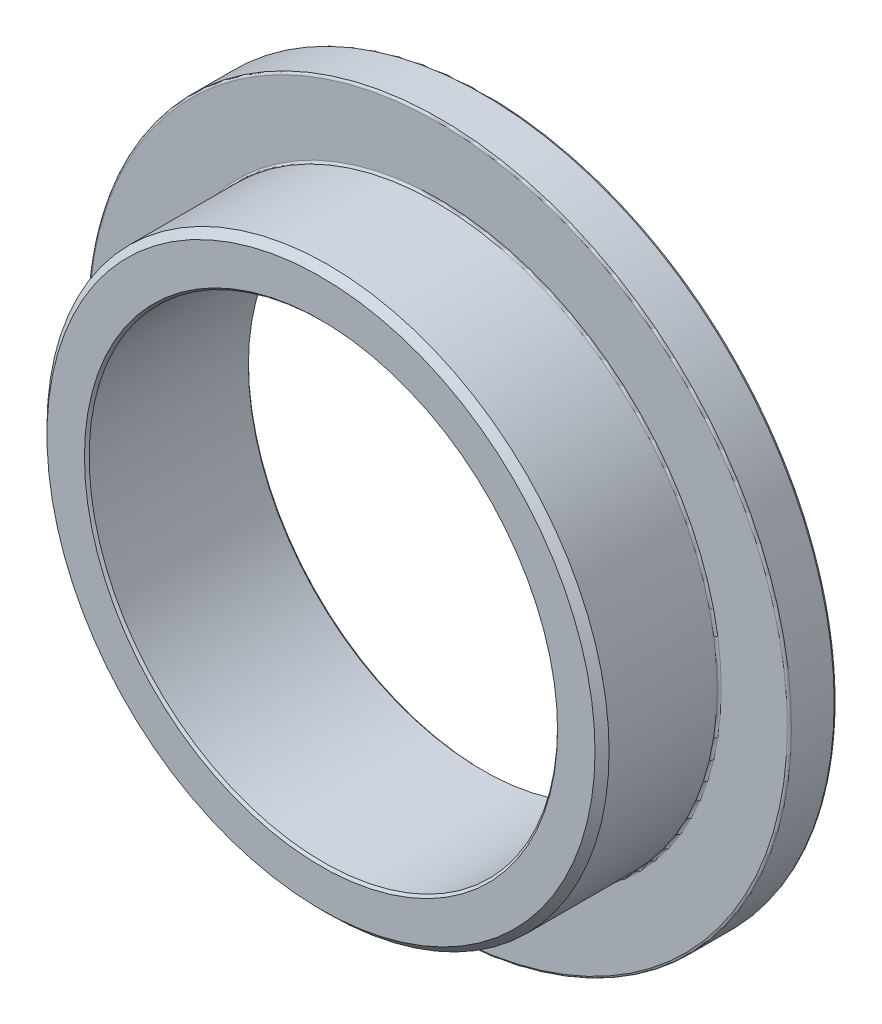
ISO-10303-21;
HEADER;
FILE_DESCRIPTION(('STEP AP214'),'2;1');
FILE_NAME('part.step','',(''),(''),'','','');
FILE_SCHEMA(('AUTOMOTIVE_DESIGN { 1 0 10303 214 1 1 1 1 }'));
ENDSEC;
DATA;
#1=APPLICATION_CONTEXT('core data for automotive mechanical design processes');
#2=APPLICATION_PROTOCOL_DEFINITION('international standard','automotive_design',2000,#1);
#3=PRODUCT_CONTEXT('',#1,'mechanical');
#4=PRODUCT('Part','Part','',(#3));
#5=PRODUCT_RELATED_PRODUCT_CATEGORY('part','',(#4));
#6=PRODUCT_DEFINITION_FORMATION('','',#4);
#7=PRODUCT_DEFINITION_CONTEXT('part definition',#1,'design');
#8=PRODUCT_DEFINITION('design','',#6,#7);
#9=PRODUCT_DEFINITION_SHAPE('','',#8);
#10=(LENGTH_UNIT() NAMED_UNIT(*) SI_UNIT(.MILLI.,.METRE.));
#11=(NAMED_UNIT(*) PLANE_ANGLE_UNIT() SI_UNIT($,.RADIAN.));
#12=(NAMED_UNIT(*) SI_UNIT($,.STERADIAN.) SOLID_ANGLE_UNIT());
#13=UNCERTAINTY_MEASURE_WITH_UNIT(LENGTH_MEASURE(1.E-05),#10,'distance_accuracy_value','');
#14=(GEOMETRIC_REPRESENTATION_CONTEXT(3) GLOBAL_UNCERTAINTY_ASSIGNED_CONTEXT((#13)) GLOBAL_UNIT_ASSIGNED_CONTEXT((#10,
#11,#12)) REPRESENTATION_CONTEXT('',''));
#15=CARTESIAN_POINT('',(0.,0.,0.));
#16=DIRECTION('',(0.,0.,1.));
#17=DIRECTION('',(1.,0.,0.));
#18=AXIS2_PLACEMENT_3D('',#15,#16,#17);
#19=CARTESIAN_POINT('',(0.,-5.,-1.75));
#20=DIRECTION('',(0.,0.,-1.));
#21=DIRECTION('',(-1.,0.,0.));
#22=AXIS2_PLACEMENT_3D('',#19,#20,#21);
#23=PLANE('',#22);
#24=CARTESIAN_POINT('',(0.,0.,-1.75));
#25=DIRECTION('',(0.,0.,-1.));
#26=DIRECTION('',(-1.,0.,0.));
#27=AXIS2_PLACEMENT_3D('',#24,#25,#26);
#28=CIRCLE('',#27,7.455);
#29=CARTESIAN_POINT('',(-7.455,0.,-1.75));
#30=VERTEX_POINT('',#29);
#31=EDGE_CURVE('E48',#30,#30,#28,.T.);
#32=ORIENTED_EDGE('',*,*,#31,.T.);
#33=EDGE_LOOP('',(#32));
#34=FACE_BOUND('',#33,.T.);
#35=CARTESIAN_POINT('',(0.,0.,-1.75));
#36=DIRECTION('',(0.,0.,-1.));
#37=DIRECTION('',(-1.,0.,0.));
#38=AXIS2_PLACEMENT_3D('',#35,#36,#37);
#39=CIRCLE('',#38,5.05);
#40=CARTESIAN_POINT('',(-5.05,0.,-1.75));
#41=VERTEX_POINT('',#40);
#42=EDGE_CURVE('E68',#41,#41,#39,.F.);
#43=ORIENTED_EDGE('',*,*,#42,.T.);
#44=EDGE_LOOP('',(#43));
#45=FACE_BOUND('',#44,.T.);
#46=ADVANCED_FACE('F33',(#34,#45),#23,.T.);
#47=CARTESIAN_POINT('',(0.,0.,1.75));
#48=DIRECTION('',(0.,0.,1.));
#49=DIRECTION('',(1.,0.,0.));
#50=AXIS2_PLACEMENT_3D('',#47,#48,#49);
#51=CYLINDRICAL_SURFACE('',#50,7.5);
#52=CARTESIAN_POINT('',(0.,0.,-1.705));
#53=DIRECTION('',(0.,0.,-1.));
#54=DIRECTION('',(-1.,0.,0.));
#55=AXIS2_PLACEMENT_3D('',#52,#53,#54);
#56=CIRCLE('',#55,7.5);
#57=CARTESIAN_POINT('',(-7.5,0.,-1.705));
#58=VERTEX_POINT('',#57);
#59=EDGE_CURVE('E53',#58,#58,#56,.F.);
#60=ORIENTED_EDGE('',*,*,#59,.T.);
#61=EDGE_LOOP('',(#60));
#62=FACE_BOUND('',#61,.T.);
#63=CARTESIAN_POINT('',(0.,0.,-0.795000000000001));
#64=DIRECTION('',(0.,0.,1.));
#65=DIRECTION('',(1.,0.,0.));
#66=AXIS2_PLACEMENT_3D('',#63,#64,#65);
#67=CIRCLE('',#66,7.5);
#68=CARTESIAN_POINT('',(7.5,0.,-0.795000000000001));
#69=VERTEX_POINT('',#68);
#70=EDGE_CURVE('E56',#69,#69,#67,.F.);
#71=ORIENTED_EDGE('',*,*,#70,.T.);
#72=EDGE_LOOP('',(#71));
#73=FACE_BOUND('',#72,.T.);
#74=ADVANCED_FACE('F98',(#62,#73),#51,.T.);
#75=CARTESIAN_POINT('',(0.,-7.5,-0.750000000000002));
#76=DIRECTION('',(0.,0.,1.));
#77=DIRECTION('',(1.,0.,0.));
#78=AXIS2_PLACEMENT_3D('',#75,#76,#77);
#79=PLANE('',#78);
#80=CARTESIAN_POINT('',(0.,0.,-0.750000000000002));
#81=DIRECTION('',(0.,0.,1.));
#82=DIRECTION('',(1.,0.,0.));
#83=AXIS2_PLACEMENT_3D('',#80,#81,#82);
#84=CIRCLE('',#83,6.045);
#85=CARTESIAN_POINT('',(6.045,0.,-0.750000000000002));
#86=VERTEX_POINT('',#85);
#87=EDGE_CURVE('E10',#86,#86,#84,.F.);
#88=ORIENTED_EDGE('',*,*,#87,.T.);
#89=EDGE_LOOP('',(#88));
#90=FACE_BOUND('',#89,.T.);
#91=CARTESIAN_POINT('',(0.,0.,-0.750000000000002));
#92=DIRECTION('',(0.,0.,1.));
#93=DIRECTION('',(1.,0.,0.));
#94=AXIS2_PLACEMENT_3D('',#91,#92,#93);
#95=CIRCLE('',#94,7.455);
#96=CARTESIAN_POINT('',(7.455,0.,-0.750000000000002));
#97=VERTEX_POINT('',#96);
#98=EDGE_CURVE('E40',#97,#97,#95,.T.);
#99=ORIENTED_EDGE('',*,*,#98,.T.);
#100=EDGE_LOOP('',(#99));
#101=FACE_BOUND('',#100,.T.);
#102=ADVANCED_FACE('F103',(#90,#101),#79,.T.);
#103=CARTESIAN_POINT('',(0.,0.,1.75));
#104=DIRECTION('',(0.,0.,1.));
#105=DIRECTION('',(1.,0.,0.));
#106=AXIS2_PLACEMENT_3D('',#103,#104,#105);
#107=CYLINDRICAL_SURFACE('',#106,6.);
#108=CARTESIAN_POINT('',(0.,0.,-0.705000000000002));
#109=DIRECTION('',(0.,0.,1.));
#110=DIRECTION('',(1.,0.,0.));
#111=AXIS2_PLACEMENT_3D('',#108,#109,#110);
#112=CIRCLE('',#111,6.);
#113=CARTESIAN_POINT('',(6.,0.,-0.705000000000002));
#114=VERTEX_POINT('',#113);
#115=EDGE_CURVE('E44',#114,#114,#112,.T.);
#116=ORIENTED_EDGE('',*,*,#115,.T.);
#117=EDGE_LOOP('',(#116));
#118=FACE_BOUND('',#117,.T.);
#119=CARTESIAN_POINT('',(0.,0.,1.6));
#120=DIRECTION('',(0.,0.,1.));
#121=DIRECTION('',(1.,0.,0.));
#122=AXIS2_PLACEMENT_3D('',#119,#120,#121);
#123=CIRCLE('',#122,6.);
#124=CARTESIAN_POINT('',(6.,0.,1.6));
#125=VERTEX_POINT('',#124);
#126=EDGE_CURVE('E71',#125,#125,#123,.F.);
#127=ORIENTED_EDGE('',*,*,#126,.T.);
#128=EDGE_LOOP('',(#127));
#129=FACE_BOUND('',#128,.T.);
#130=ADVANCED_FACE('F110',(#118,#129),#107,.T.);
#131=CARTESIAN_POINT('',(0.,-6.,1.75));
#132=DIRECTION('',(0.,0.,1.));
#133=DIRECTION('',(1.,0.,0.));
#134=AXIS2_PLACEMENT_3D('',#131,#132,#133);
#135=PLANE('',#134);
#136=CARTESIAN_POINT('',(0.,0.,1.75));
#137=DIRECTION('',(0.,0.,1.));
#138=DIRECTION('',(1.,0.,0.));
#139=AXIS2_PLACEMENT_3D('',#136,#137,#138);
#140=CIRCLE('',#139,5.05);
#141=CARTESIAN_POINT('',(5.05,0.,1.75));
#142=VERTEX_POINT('',#141);
#143=EDGE_CURVE('E59',#142,#142,#140,.F.);
#144=ORIENTED_EDGE('',*,*,#143,.T.);
#145=EDGE_LOOP('',(#144));
#146=FACE_BOUND('',#145,.T.);
#147=CARTESIAN_POINT('',(0.,0.,1.75));
#148=DIRECTION('',(0.,0.,1.));
#149=DIRECTION('',(1.,0.,0.));
#150=AXIS2_PLACEMENT_3D('',#147,#148,#149);
#151=CIRCLE('',#150,5.85);
#152=CARTESIAN_POINT('',(5.85,0.,1.75));
#153=VERTEX_POINT('',#152);
#154=EDGE_CURVE('E74',#153,#153,#151,.T.);
#155=ORIENTED_EDGE('',*,*,#154,.T.);
#156=EDGE_LOOP('',(#155));
#157=FACE_BOUND('',#156,.T.);
#158=ADVANCED_FACE('F78',(#146,#157),#135,.T.);
#159=CARTESIAN_POINT('',(0.,0.,1.75));
#160=DIRECTION('',(0.,0.,1.));
#161=DIRECTION('',(1.,0.,0.));
#162=AXIS2_PLACEMENT_3D('',#159,#160,#161);
#163=CYLINDRICAL_SURFACE('',#162,5.);
#164=CARTESIAN_POINT('',(0.,0.,-1.7));
#165=DIRECTION('',(0.,0.,-1.));
#166=DIRECTION('',(-1.,0.,0.));
#167=AXIS2_PLACEMENT_3D('',#164,#165,#166);
#168=CIRCLE('',#167,5.);
#169=CARTESIAN_POINT('',(-5.,0.,-1.7));
#170=VERTEX_POINT('',#169);
#171=EDGE_CURVE('E62',#170,#170,#168,.T.);
#172=ORIENTED_EDGE('',*,*,#171,.T.);
#173=EDGE_LOOP('',(#172));
#174=FACE_BOUND('',#173,.T.);
#175=CARTESIAN_POINT('',(0.,0.,1.70000000000001));
#176=DIRECTION('',(0.,0.,1.));
#177=DIRECTION('',(1.,0.,0.));
#178=AXIS2_PLACEMENT_3D('',#175,#176,#177);
#179=CIRCLE('',#178,5.);
#180=CARTESIAN_POINT('',(5.,0.,1.70000000000001));
#181=VERTEX_POINT('',#180);
#182=EDGE_CURVE('E65',#181,#181,#179,.T.);
#183=ORIENTED_EDGE('',*,*,#182,.T.);
#184=EDGE_LOOP('',(#183));
#185=FACE_BOUND('',#184,.T.);
#186=ADVANCED_FACE('F83',(#174,#185),#163,.F.);
#187=CARTESIAN_POINT('',(0.,0.,1.75));
#188=DIRECTION('',(0.,0.,-1.));
#189=DIRECTION('',(-1.,0.,0.));
#190=AXIS2_PLACEMENT_3D('',#187,#188,#189);
#191=CONICAL_SURFACE('',#190,5.85,0.785398163397451);
#192=ORIENTED_EDGE('',*,*,#126,.F.);
#193=EDGE_LOOP('',(#192));
#194=FACE_BOUND('',#193,.T.);
#195=ORIENTED_EDGE('',*,*,#154,.F.);
#196=EDGE_LOOP('',(#195));
#197=FACE_BOUND('',#196,.T.);
#198=ADVANCED_FACE('F80',(#194,#197),#191,.T.);
#199=CARTESIAN_POINT('',(0.,0.,-1.75));
#200=DIRECTION('',(0.,0.,-1.));
#201=DIRECTION('',(-1.,0.,0.));
#202=AXIS2_PLACEMENT_3D('',#199,#200,#201);
#203=CONICAL_SURFACE('',#202,5.05,0.785398163397448);
#204=ORIENTED_EDGE('',*,*,#171,.F.);
#205=EDGE_LOOP('',(#204));
#206=FACE_BOUND('',#205,.T.);
#207=ORIENTED_EDGE('',*,*,#42,.F.);
#208=EDGE_LOOP('',(#207));
#209=FACE_BOUND('',#208,.T.);
#210=ADVANCED_FACE('F82',(#206,#209),#203,.F.);
#211=CARTESIAN_POINT('',(0.,0.,1.70000000000001));
#212=DIRECTION('',(0.,0.,1.));
#213=DIRECTION('',(1.,0.,0.));
#214=AXIS2_PLACEMENT_3D('',#211,#212,#213);
#215=CONICAL_SURFACE('',#214,5.,0.785398163397457);
#216=ORIENTED_EDGE('',*,*,#143,.F.);
#217=EDGE_LOOP('',(#216));
#218=FACE_BOUND('',#217,.T.);
#219=ORIENTED_EDGE('',*,*,#182,.F.);
#220=EDGE_LOOP('',(#219));
#221=FACE_BOUND('',#220,.T.);
#222=ADVANCED_FACE('F90',(#218,#221),#215,.F.);
#223=CARTESIAN_POINT('',(0.,0.,-1.705));
#224=DIRECTION('',(0.,0.,-1.));
#225=DIRECTION('',(-1.,0.,0.));
#226=AXIS2_PLACEMENT_3D('',#223,#224,#225);
#227=TOROIDAL_SURFACE('',#226,7.455,0.045);
#228=ORIENTED_EDGE('',*,*,#31,.F.);
#229=EDGE_LOOP('',(#228));
#230=FACE_BOUND('',#229,.T.);
#231=ORIENTED_EDGE('',*,*,#59,.F.);
#232=EDGE_LOOP('',(#231));
#233=FACE_BOUND('',#232,.T.);
#234=ADVANCED_FACE('F122',(#230,#233),#227,.T.);
#235=CARTESIAN_POINT('',(0.,0.,-0.705000000000002));
#236=DIRECTION('',(0.,0.,1.));
#237=DIRECTION('',(1.,0.,0.));
#238=AXIS2_PLACEMENT_3D('',#235,#236,#237);
#239=TOROIDAL_SURFACE('',#238,6.045,0.045);
#240=ORIENTED_EDGE('',*,*,#87,.F.);
#241=EDGE_LOOP('',(#240));
#242=FACE_BOUND('',#241,.T.);
#243=ORIENTED_EDGE('',*,*,#115,.F.);
#244=EDGE_LOOP('',(#243));
#245=FACE_BOUND('',#244,.T.);
#246=ADVANCED_FACE('F129',(#242,#245),#239,.F.);
#247=CARTESIAN_POINT('',(0.,0.,-0.795000000000001));
#248=DIRECTION('',(0.,0.,1.));
#249=DIRECTION('',(1.,0.,0.));
#250=AXIS2_PLACEMENT_3D('',#247,#248,#249);
#251=TOROIDAL_SURFACE('',#250,7.455,0.045);
#252=ORIENTED_EDGE('',*,*,#70,.F.);
#253=EDGE_LOOP('',(#252));
#254=FACE_BOUND('',#253,.T.);
#255=ORIENTED_EDGE('',*,*,#98,.F.);
#256=EDGE_LOOP('',(#255));
#257=FACE_BOUND('',#256,.T.);
#258=ADVANCED_FACE('F35',(#254,#257),#251,.T.);
#259=CLOSED_SHELL('',(#46,#74,#102,#130,#158,#186,#198,#210,#222,#234,#246,#258));
#260=MANIFOLD_SOLID_BREP('B2',#259);
#261=ADVANCED_BREP_SHAPE_REPRESENTATION('',(#18,#260),#14);
#262=SHAPE_DEFINITION_REPRESENTATION(#9,#261);
ENDSEC;
END-ISO-10303-21;
